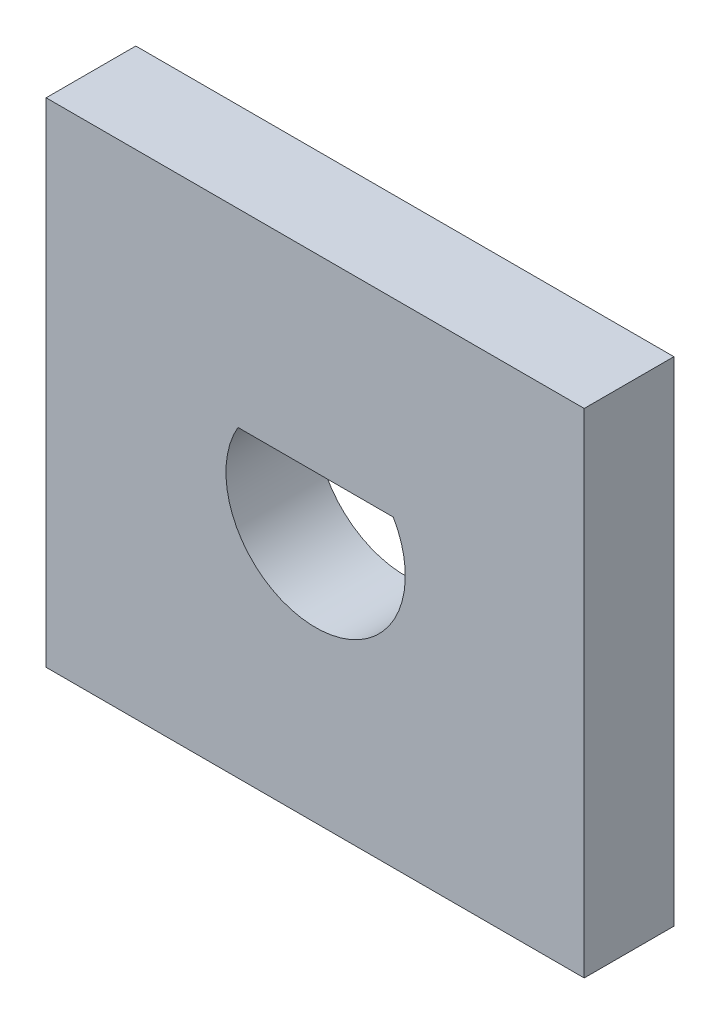
ISO-10303-21;
HEADER;
FILE_DESCRIPTION(('STEP AP214'),'2;1');
FILE_NAME('part.step','',(''),(''),'','','');
FILE_SCHEMA(('AUTOMOTIVE_DESIGN { 1 0 10303 214 1 1 1 1 }'));
ENDSEC;
DATA;
#1=APPLICATION_CONTEXT('core data for automotive mechanical design processes');
#2=APPLICATION_PROTOCOL_DEFINITION('international standard','automotive_design',2000,#1);
#3=PRODUCT_CONTEXT('',#1,'mechanical');
#4=PRODUCT('Part','Part','',(#3));
#5=PRODUCT_RELATED_PRODUCT_CATEGORY('part','',(#4));
#6=PRODUCT_DEFINITION_FORMATION('','',#4);
#7=PRODUCT_DEFINITION_CONTEXT('part definition',#1,'design');
#8=PRODUCT_DEFINITION('design','',#6,#7);
#9=PRODUCT_DEFINITION_SHAPE('','',#8);
#10=(LENGTH_UNIT() NAMED_UNIT(*) SI_UNIT(.MILLI.,.METRE.));
#11=(NAMED_UNIT(*) PLANE_ANGLE_UNIT() SI_UNIT($,.RADIAN.));
#12=(NAMED_UNIT(*) SI_UNIT($,.STERADIAN.) SOLID_ANGLE_UNIT());
#13=UNCERTAINTY_MEASURE_WITH_UNIT(LENGTH_MEASURE(1.E-05),#10,'distance_accuracy_value','');
#14=(GEOMETRIC_REPRESENTATION_CONTEXT(3) GLOBAL_UNCERTAINTY_ASSIGNED_CONTEXT((#13)) GLOBAL_UNIT_ASSIGNED_CONTEXT((#10,
#11,#12)) REPRESENTATION_CONTEXT('',''));
#15=CARTESIAN_POINT('',(0.,0.,0.));
#16=DIRECTION('',(0.,0.,1.));
#17=DIRECTION('',(1.,0.,0.));
#18=AXIS2_PLACEMENT_3D('',#15,#16,#17);
#19=CARTESIAN_POINT('',(-6.01026727509778,5.2271186440678,2.));
#20=DIRECTION('',(0.,1.,0.));
#21=DIRECTION('',(0.,0.,1.));
#22=AXIS2_PLACEMENT_3D('',#19,#20,#21);
#23=PLANE('',#22);
#24=DIRECTION('',(1.,0.,0.));
#25=VECTOR('',#24,1.);
#26=CARTESIAN_POINT('',(-6.01026727509778,5.2271186440678,0.));
#27=LINE('',#26,#25);
#28=CARTESIAN_POINT('',(-6.01026727509778,5.2271186440678,0.));
#29=VERTEX_POINT('',#28);
#30=CARTESIAN_POINT('',(5.98973272490222,5.2271186440678,0.));
#31=VERTEX_POINT('',#30);
#32=EDGE_CURVE('E105',#29,#31,#27,.T.);
#33=ORIENTED_EDGE('',*,*,#32,.F.);
#34=DIRECTION('',(0.,0.,-1.));
#35=VECTOR('',#34,1.);
#36=CARTESIAN_POINT('',(-6.01026727509778,5.2271186440678,2.));
#37=LINE('',#36,#35);
#38=CARTESIAN_POINT('',(-6.01026727509778,5.2271186440678,2.));
#39=VERTEX_POINT('',#38);
#40=EDGE_CURVE('E11',#39,#29,#37,.T.);
#41=ORIENTED_EDGE('',*,*,#40,.F.);
#42=DIRECTION('',(1.,0.,0.));
#43=VECTOR('',#42,1.);
#44=CARTESIAN_POINT('',(-6.01026727509778,5.2271186440678,2.));
#45=LINE('',#44,#43);
#46=CARTESIAN_POINT('',(5.98973272490222,5.2271186440678,2.));
#47=VERTEX_POINT('',#46);
#48=EDGE_CURVE('E107',#39,#47,#45,.T.);
#49=ORIENTED_EDGE('',*,*,#48,.T.);
#50=DIRECTION('',(0.,0.,-1.));
#51=VECTOR('',#50,1.);
#52=CARTESIAN_POINT('',(5.98973272490222,5.2271186440678,2.));
#53=LINE('',#52,#51);
#54=EDGE_CURVE('E39',#47,#31,#53,.T.);
#55=ORIENTED_EDGE('',*,*,#54,.T.);
#56=EDGE_LOOP('',(#33,#41,#49,#55));
#57=FACE_BOUND('',#56,.T.);
#58=ADVANCED_FACE('F36',(#57),#23,.T.);
#59=CARTESIAN_POINT('',(-6.01026727509778,5.2271186440678,2.));
#60=DIRECTION('',(1.,0.,0.));
#61=DIRECTION('',(0.,1.,0.));
#62=AXIS2_PLACEMENT_3D('',#59,#60,#61);
#63=PLANE('',#62);
#64=DIRECTION('',(0.,-1.,0.));
#65=VECTOR('',#64,1.);
#66=CARTESIAN_POINT('',(-6.01026727509778,5.2271186440678,0.));
#67=LINE('',#66,#65);
#68=CARTESIAN_POINT('',(-6.01026727509778,-5.7728813559322,0.));
#69=VERTEX_POINT('',#68);
#70=EDGE_CURVE('E111',#29,#69,#67,.T.);
#71=ORIENTED_EDGE('',*,*,#70,.T.);
#72=DIRECTION('',(0.,0.,-1.));
#73=VECTOR('',#72,1.);
#74=CARTESIAN_POINT('',(-6.01026727509778,-5.7728813559322,2.));
#75=LINE('',#74,#73);
#76=CARTESIAN_POINT('',(-6.01026727509778,-5.7728813559322,2.));
#77=VERTEX_POINT('',#76);
#78=EDGE_CURVE('E44',#77,#69,#75,.T.);
#79=ORIENTED_EDGE('',*,*,#78,.F.);
#80=DIRECTION('',(0.,-1.,0.));
#81=VECTOR('',#80,1.);
#82=CARTESIAN_POINT('',(-6.01026727509778,5.2271186440678,2.));
#83=LINE('',#82,#81);
#84=EDGE_CURVE('E116',#39,#77,#83,.T.);
#85=ORIENTED_EDGE('',*,*,#84,.F.);
#86=ORIENTED_EDGE('',*,*,#40,.T.);
#87=EDGE_LOOP('',(#71,#79,#85,#86));
#88=FACE_BOUND('',#87,.T.);
#89=ADVANCED_FACE('F141',(#88),#63,.F.);
#90=CARTESIAN_POINT('',(-6.01026727509778,-5.7728813559322,2.));
#91=DIRECTION('',(0.,1.,0.));
#92=DIRECTION('',(0.,0.,1.));
#93=AXIS2_PLACEMENT_3D('',#90,#91,#92);
#94=PLANE('',#93);
#95=DIRECTION('',(1.,0.,0.));
#96=VECTOR('',#95,1.);
#97=CARTESIAN_POINT('',(-6.01026727509778,-5.7728813559322,0.));
#98=LINE('',#97,#96);
#99=CARTESIAN_POINT('',(5.98973272490222,-5.7728813559322,0.));
#100=VERTEX_POINT('',#99);
#101=EDGE_CURVE('E123',#69,#100,#98,.T.);
#102=ORIENTED_EDGE('',*,*,#101,.T.);
#103=DIRECTION('',(0.,0.,-1.));
#104=VECTOR('',#103,1.);
#105=CARTESIAN_POINT('',(5.98973272490222,-5.7728813559322,2.));
#106=LINE('',#105,#104);
#107=CARTESIAN_POINT('',(5.98973272490222,-5.7728813559322,2.));
#108=VERTEX_POINT('',#107);
#109=EDGE_CURVE('E128',#108,#100,#106,.T.);
#110=ORIENTED_EDGE('',*,*,#109,.F.);
#111=DIRECTION('',(1.,0.,0.));
#112=VECTOR('',#111,1.);
#113=CARTESIAN_POINT('',(-6.01026727509778,-5.7728813559322,2.));
#114=LINE('',#113,#112);
#115=EDGE_CURVE('E114',#77,#108,#114,.T.);
#116=ORIENTED_EDGE('',*,*,#115,.F.);
#117=ORIENTED_EDGE('',*,*,#78,.T.);
#118=EDGE_LOOP('',(#102,#110,#116,#117));
#119=FACE_BOUND('',#118,.T.);
#120=ADVANCED_FACE('F145',(#119),#94,.F.);
#121=CARTESIAN_POINT('',(5.98973272490222,5.2271186440678,2.));
#122=DIRECTION('',(1.,0.,0.));
#123=DIRECTION('',(0.,1.,0.));
#124=AXIS2_PLACEMENT_3D('',#121,#122,#123);
#125=PLANE('',#124);
#126=DIRECTION('',(0.,-1.,0.));
#127=VECTOR('',#126,1.);
#128=CARTESIAN_POINT('',(5.98973272490222,5.2271186440678,0.));
#129=LINE('',#128,#127);
#130=EDGE_CURVE('E120',#31,#100,#129,.T.);
#131=ORIENTED_EDGE('',*,*,#130,.F.);
#132=ORIENTED_EDGE('',*,*,#54,.F.);
#133=DIRECTION('',(0.,-1.,0.));
#134=VECTOR('',#133,1.);
#135=CARTESIAN_POINT('',(5.98973272490222,5.2271186440678,2.));
#136=LINE('',#135,#134);
#137=EDGE_CURVE('E110',#47,#108,#136,.T.);
#138=ORIENTED_EDGE('',*,*,#137,.T.);
#139=ORIENTED_EDGE('',*,*,#109,.T.);
#140=EDGE_LOOP('',(#131,#132,#138,#139));
#141=FACE_BOUND('',#140,.T.);
#142=ADVANCED_FACE('F136',(#141),#125,.T.);
#143=CARTESIAN_POINT('',(0.,0.,2.));
#144=DIRECTION('',(0.,0.,-1.));
#145=DIRECTION('',(-1.,0.,0.));
#146=AXIS2_PLACEMENT_3D('',#143,#144,#145);
#147=PLANE('',#146);
#148=DIRECTION('',(1.,0.,0.));
#149=VECTOR('',#148,1.);
#150=CARTESIAN_POINT('',(0.,1.,2.));
#151=LINE('',#150,#149);
#152=CARTESIAN_POINT('',(-1.73205080756888,1.,2.));
#153=VERTEX_POINT('',#152);
#154=CARTESIAN_POINT('',(1.73205080756888,1.,2.));
#155=VERTEX_POINT('',#154);
#156=EDGE_CURVE('E100',#153,#155,#151,.T.);
#157=ORIENTED_EDGE('',*,*,#156,.T.);
#158=CARTESIAN_POINT('',(0.,0.,2.));
#159=DIRECTION('',(0.,0.,1.));
#160=DIRECTION('',(1.,0.,0.));
#161=AXIS2_PLACEMENT_3D('',#158,#159,#160);
#162=CIRCLE('',#161,2.);
#163=EDGE_CURVE('E52',#153,#155,#162,.T.);
#164=ORIENTED_EDGE('',*,*,#163,.F.);
#165=EDGE_LOOP('',(#157,#164));
#166=FACE_BOUND('',#165,.T.);
#167=ORIENTED_EDGE('',*,*,#48,.F.);
#168=ORIENTED_EDGE('',*,*,#84,.T.);
#169=ORIENTED_EDGE('',*,*,#115,.T.);
#170=ORIENTED_EDGE('',*,*,#137,.F.);
#171=EDGE_LOOP('',(#167,#168,#169,#170));
#172=FACE_BOUND('',#171,.T.);
#173=ADVANCED_FACE('F147',(#166,#172),#147,.F.);
#174=CARTESIAN_POINT('',(0.,0.,0.));
#175=DIRECTION('',(0.,0.,-1.));
#176=DIRECTION('',(-1.,0.,0.));
#177=AXIS2_PLACEMENT_3D('',#174,#175,#176);
#178=PLANE('',#177);
#179=CARTESIAN_POINT('',(0.,0.,0.));
#180=DIRECTION('',(0.,0.,1.));
#181=DIRECTION('',(1.,0.,0.));
#182=AXIS2_PLACEMENT_3D('',#179,#180,#181);
#183=CIRCLE('',#182,2.);
#184=CARTESIAN_POINT('',(-1.73205080756888,1.,0.));
#185=VERTEX_POINT('',#184);
#186=CARTESIAN_POINT('',(1.73205080756888,1.,0.));
#187=VERTEX_POINT('',#186);
#188=EDGE_CURVE('E57',#185,#187,#183,.T.);
#189=ORIENTED_EDGE('',*,*,#188,.T.);
#190=DIRECTION('',(1.,0.,0.));
#191=VECTOR('',#190,1.);
#192=CARTESIAN_POINT('',(0.,1.,0.));
#193=LINE('',#192,#191);
#194=EDGE_CURVE('E88',#185,#187,#193,.T.);
#195=ORIENTED_EDGE('',*,*,#194,.F.);
#196=EDGE_LOOP('',(#189,#195));
#197=FACE_BOUND('',#196,.T.);
#198=ORIENTED_EDGE('',*,*,#32,.T.);
#199=ORIENTED_EDGE('',*,*,#130,.T.);
#200=ORIENTED_EDGE('',*,*,#101,.F.);
#201=ORIENTED_EDGE('',*,*,#70,.F.);
#202=EDGE_LOOP('',(#198,#199,#200,#201));
#203=FACE_BOUND('',#202,.T.);
#204=ADVANCED_FACE('F98',(#197,#203),#178,.T.);
#205=CARTESIAN_POINT('',(0.,0.,0.));
#206=DIRECTION('',(0.,0.,1.));
#207=DIRECTION('',(1.,0.,0.));
#208=AXIS2_PLACEMENT_3D('',#205,#206,#207);
#209=CYLINDRICAL_SURFACE('',#208,2.);
#210=ORIENTED_EDGE('',*,*,#163,.T.);
#211=DIRECTION('',(0.,0.,1.));
#212=VECTOR('',#211,1.);
#213=CARTESIAN_POINT('',(1.73205080756888,1.,0.));
#214=LINE('',#213,#212);
#215=EDGE_CURVE('E91',#187,#155,#214,.T.);
#216=ORIENTED_EDGE('',*,*,#215,.F.);
#217=ORIENTED_EDGE('',*,*,#188,.F.);
#218=DIRECTION('',(0.,0.,1.));
#219=VECTOR('',#218,1.);
#220=CARTESIAN_POINT('',(-1.73205080756888,1.,0.));
#221=LINE('',#220,#219);
#222=EDGE_CURVE('E93',#185,#153,#221,.T.);
#223=ORIENTED_EDGE('',*,*,#222,.T.);
#224=EDGE_LOOP('',(#210,#216,#217,#223));
#225=FACE_BOUND('',#224,.T.);
#226=ADVANCED_FACE('F96',(#225),#209,.F.);
#227=CARTESIAN_POINT('',(0.,1.,0.));
#228=DIRECTION('',(0.,-1.,0.));
#229=DIRECTION('',(0.,0.,-1.));
#230=AXIS2_PLACEMENT_3D('',#227,#228,#229);
#231=PLANE('',#230);
#232=ORIENTED_EDGE('',*,*,#156,.F.);
#233=ORIENTED_EDGE('',*,*,#222,.F.);
#234=ORIENTED_EDGE('',*,*,#194,.T.);
#235=ORIENTED_EDGE('',*,*,#215,.T.);
#236=EDGE_LOOP('',(#232,#233,#234,#235));
#237=FACE_BOUND('',#236,.T.);
#238=ADVANCED_FACE('F90',(#237),#231,.T.);
#239=CLOSED_SHELL('',(#58,#89,#120,#142,#173,#204,#226,#238));
#240=MANIFOLD_SOLID_BREP('B2',#239);
#241=ADVANCED_BREP_SHAPE_REPRESENTATION('',(#18,#240),#14);
#242=SHAPE_DEFINITION_REPRESENTATION(#9,#241);
ENDSEC;
END-ISO-10303-21;
